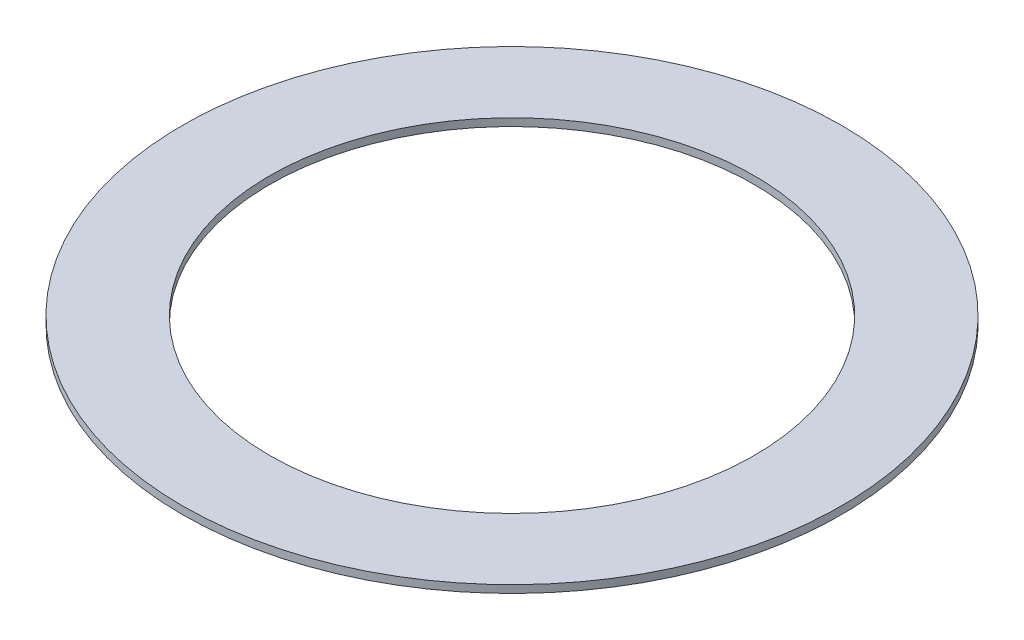
ISO-10303-21;
HEADER;
FILE_DESCRIPTION(('STEP AP214'),'2;1');
FILE_NAME('part.step','',(''),(''),'','','');
FILE_SCHEMA(('AUTOMOTIVE_DESIGN { 1 0 10303 214 1 1 1 1 }'));
ENDSEC;
DATA;
#1=APPLICATION_CONTEXT('core data for automotive mechanical design processes');
#2=APPLICATION_PROTOCOL_DEFINITION('international standard','automotive_design',2000,#1);
#3=PRODUCT_CONTEXT('',#1,'mechanical');
#4=PRODUCT('Part','Part','',(#3));
#5=PRODUCT_RELATED_PRODUCT_CATEGORY('part','',(#4));
#6=PRODUCT_DEFINITION_FORMATION('','',#4);
#7=PRODUCT_DEFINITION_CONTEXT('part definition',#1,'design');
#8=PRODUCT_DEFINITION('design','',#6,#7);
#9=PRODUCT_DEFINITION_SHAPE('','',#8);
#10=(LENGTH_UNIT() NAMED_UNIT(*) SI_UNIT(.MILLI.,.METRE.));
#11=(NAMED_UNIT(*) PLANE_ANGLE_UNIT() SI_UNIT($,.RADIAN.));
#12=(NAMED_UNIT(*) SI_UNIT($,.STERADIAN.) SOLID_ANGLE_UNIT());
#13=UNCERTAINTY_MEASURE_WITH_UNIT(LENGTH_MEASURE(1.E-05),#10,'distance_accuracy_value','');
#14=(GEOMETRIC_REPRESENTATION_CONTEXT(3) GLOBAL_UNCERTAINTY_ASSIGNED_CONTEXT((#13)) GLOBAL_UNIT_ASSIGNED_CONTEXT((#10,
#11,#12)) REPRESENTATION_CONTEXT('',''));
#15=CARTESIAN_POINT('',(0.,0.,0.));
#16=DIRECTION('',(0.,0.,1.));
#17=DIRECTION('',(1.,0.,0.));
#18=AXIS2_PLACEMENT_3D('',#15,#16,#17);
#19=CARTESIAN_POINT('',(0.,2.4,0.));
#20=DIRECTION('',(0.,1.,0.));
#21=DIRECTION('',(0.,0.,1.));
#22=AXIS2_PLACEMENT_3D('',#19,#20,#21);
#23=PLANE('',#22);
#24=CARTESIAN_POINT('',(0.,2.4,0.));
#25=DIRECTION('',(0.,1.,0.));
#26=DIRECTION('',(0.,0.,1.));
#27=AXIS2_PLACEMENT_3D('',#24,#25,#26);
#28=CIRCLE('',#27,103.632);
#29=CARTESIAN_POINT('',(0.,2.4,103.632));
#30=VERTEX_POINT('',#29);
#31=EDGE_CURVE('E10',#30,#30,#28,.T.);
#32=ORIENTED_EDGE('',*,*,#31,.T.);
#33=EDGE_LOOP('',(#32));
#34=FACE_BOUND('',#33,.T.);
#35=CARTESIAN_POINT('',(0.,2.4,0.));
#36=DIRECTION('',(0.,1.,0.));
#37=DIRECTION('',(0.,0.,1.));
#38=AXIS2_PLACEMENT_3D('',#35,#36,#37);
#39=CIRCLE('',#38,76.2);
#40=CARTESIAN_POINT('',(0.,2.4,76.2));
#41=VERTEX_POINT('',#40);
#42=EDGE_CURVE('E43',#41,#41,#39,.T.);
#43=ORIENTED_EDGE('',*,*,#42,.F.);
#44=EDGE_LOOP('',(#43));
#45=FACE_BOUND('',#44,.T.);
#46=ADVANCED_FACE('F32',(#34,#45),#23,.T.);
#47=CARTESIAN_POINT('',(0.,0.,0.));
#48=DIRECTION('',(0.,1.,0.));
#49=DIRECTION('',(0.,0.,1.));
#50=AXIS2_PLACEMENT_3D('',#47,#48,#49);
#51=PLANE('',#50);
#52=CARTESIAN_POINT('',(0.,0.,0.));
#53=DIRECTION('',(0.,1.,0.));
#54=DIRECTION('',(0.,0.,1.));
#55=AXIS2_PLACEMENT_3D('',#52,#53,#54);
#56=CIRCLE('',#55,103.632);
#57=CARTESIAN_POINT('',(0.,0.,103.632));
#58=VERTEX_POINT('',#57);
#59=EDGE_CURVE('E36',#58,#58,#56,.T.);
#60=ORIENTED_EDGE('',*,*,#59,.F.);
#61=EDGE_LOOP('',(#60));
#62=FACE_BOUND('',#61,.T.);
#63=CARTESIAN_POINT('',(0.,0.,0.));
#64=DIRECTION('',(0.,1.,0.));
#65=DIRECTION('',(0.,0.,1.));
#66=AXIS2_PLACEMENT_3D('',#63,#64,#65);
#67=CIRCLE('',#66,76.2);
#68=CARTESIAN_POINT('',(0.,0.,76.2));
#69=VERTEX_POINT('',#68);
#70=EDGE_CURVE('E45',#69,#69,#67,.T.);
#71=ORIENTED_EDGE('',*,*,#70,.T.);
#72=EDGE_LOOP('',(#71));
#73=FACE_BOUND('',#72,.T.);
#74=ADVANCED_FACE('F55',(#62,#73),#51,.F.);
#75=CARTESIAN_POINT('',(0.,2.4,0.));
#76=DIRECTION('',(0.,-1.,0.));
#77=DIRECTION('',(0.,0.,-1.));
#78=AXIS2_PLACEMENT_3D('',#75,#76,#77);
#79=CYLINDRICAL_SURFACE('',#78,103.632);
#80=ORIENTED_EDGE('',*,*,#31,.F.);
#81=EDGE_LOOP('',(#80));
#82=FACE_BOUND('',#81,.T.);
#83=ORIENTED_EDGE('',*,*,#59,.T.);
#84=EDGE_LOOP('',(#83));
#85=FACE_BOUND('',#84,.T.);
#86=ADVANCED_FACE('F34',(#82,#85),#79,.T.);
#87=CARTESIAN_POINT('',(0.,2.4,0.));
#88=DIRECTION('',(0.,-1.,0.));
#89=DIRECTION('',(0.,0.,-1.));
#90=AXIS2_PLACEMENT_3D('',#87,#88,#89);
#91=CYLINDRICAL_SURFACE('',#90,76.2);
#92=ORIENTED_EDGE('',*,*,#42,.T.);
#93=EDGE_LOOP('',(#92));
#94=FACE_BOUND('',#93,.T.);
#95=ORIENTED_EDGE('',*,*,#70,.F.);
#96=EDGE_LOOP('',(#95));
#97=FACE_BOUND('',#96,.T.);
#98=ADVANCED_FACE('F51',(#94,#97),#91,.F.);
#99=CLOSED_SHELL('',(#46,#74,#86,#98));
#100=MANIFOLD_SOLID_BREP('B2',#99);
#101=ADVANCED_BREP_SHAPE_REPRESENTATION('',(#18,#100),#14);
#102=SHAPE_DEFINITION_REPRESENTATION(#9,#101);
ENDSEC;
END-ISO-10303-21;
